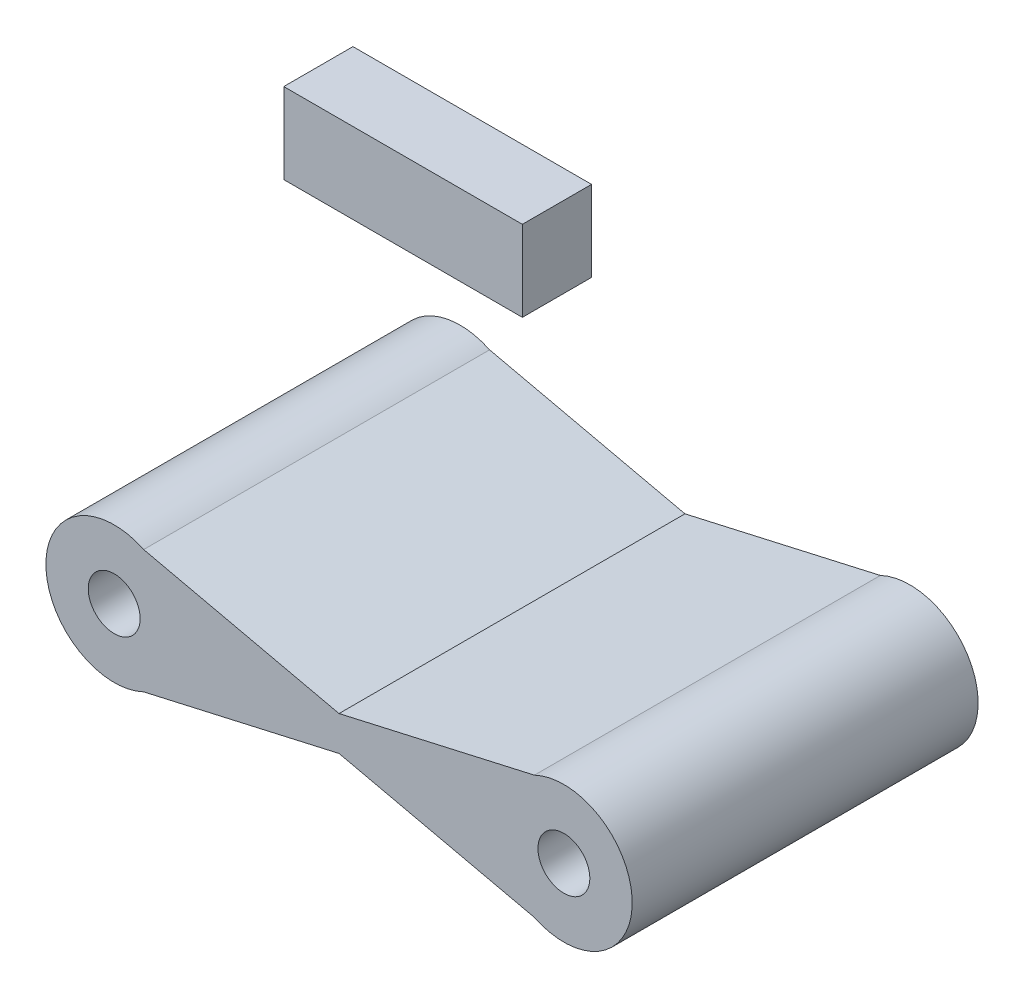
ISO-10303-21;
HEADER;
FILE_DESCRIPTION(('STEP AP214'),'2;1');
FILE_NAME('part.step','',(''),(''),'','','');
FILE_SCHEMA(('AUTOMOTIVE_DESIGN { 1 0 10303 214 1 1 1 1 }'));
ENDSEC;
DATA;
#1=APPLICATION_CONTEXT('core data for automotive mechanical design processes');
#2=APPLICATION_PROTOCOL_DEFINITION('international standard','automotive_design',2000,#1);
#3=PRODUCT_CONTEXT('',#1,'mechanical');
#4=PRODUCT('Part','Part','',(#3));
#5=PRODUCT_RELATED_PRODUCT_CATEGORY('part','',(#4));
#6=PRODUCT_DEFINITION_FORMATION('','',#4);
#7=PRODUCT_DEFINITION_CONTEXT('part definition',#1,'design');
#8=PRODUCT_DEFINITION('design','',#6,#7);
#9=PRODUCT_DEFINITION_SHAPE('','',#8);
#10=(LENGTH_UNIT() NAMED_UNIT(*) SI_UNIT(.MILLI.,.METRE.));
#11=(NAMED_UNIT(*) PLANE_ANGLE_UNIT() SI_UNIT($,.RADIAN.));
#12=(NAMED_UNIT(*) SI_UNIT($,.STERADIAN.) SOLID_ANGLE_UNIT());
#13=UNCERTAINTY_MEASURE_WITH_UNIT(LENGTH_MEASURE(1.E-05),#10,'distance_accuracy_value','');
#14=(GEOMETRIC_REPRESENTATION_CONTEXT(3) GLOBAL_UNCERTAINTY_ASSIGNED_CONTEXT((#13)) GLOBAL_UNIT_ASSIGNED_CONTEXT((#10,
#11,#12)) REPRESENTATION_CONTEXT('',''));
#15=CARTESIAN_POINT('',(0.,0.,0.));
#16=DIRECTION('',(0.,0.,1.));
#17=DIRECTION('',(1.,0.,0.));
#18=AXIS2_PLACEMENT_3D('',#15,#16,#17);
#19=CARTESIAN_POINT('',(3.79954310221819,7.89798638635375,2.));
#20=DIRECTION('',(1.,0.,0.));
#21=DIRECTION('',(0.,0.,-1.));
#22=AXIS2_PLACEMENT_3D('',#19,#20,#21);
#23=PLANE('',#22);
#24=DIRECTION('',(0.,-1.,0.));
#25=VECTOR('',#24,1.);
#26=CARTESIAN_POINT('',(3.79954310221819,7.89798638635375,0.));
#27=LINE('',#26,#25);
#28=CARTESIAN_POINT('',(3.79954310221819,7.89798638635375,0.));
#29=VERTEX_POINT('',#28);
#30=CARTESIAN_POINT('',(3.79954310221819,5.56807422900363,0.));
#31=VERTEX_POINT('',#30);
#32=EDGE_CURVE('E109',#29,#31,#27,.T.);
#33=ORIENTED_EDGE('',*,*,#32,.F.);
#34=DIRECTION('',(0.,0.,-1.));
#35=VECTOR('',#34,1.);
#36=CARTESIAN_POINT('',(3.79954310221819,7.89798638635375,2.));
#37=LINE('',#36,#35);
#38=CARTESIAN_POINT('',(3.79954310221819,7.89798638635375,2.));
#39=VERTEX_POINT('',#38);
#40=EDGE_CURVE('E12',#39,#29,#37,.T.);
#41=ORIENTED_EDGE('',*,*,#40,.F.);
#42=DIRECTION('',(0.,-1.,0.));
#43=VECTOR('',#42,1.);
#44=CARTESIAN_POINT('',(3.79954310221819,7.89798638635375,2.));
#45=LINE('',#44,#43);
#46=CARTESIAN_POINT('',(3.79954310221819,5.56807422900363,2.));
#47=VERTEX_POINT('',#46);
#48=EDGE_CURVE('E103',#39,#47,#45,.T.);
#49=ORIENTED_EDGE('',*,*,#48,.T.);
#50=DIRECTION('',(0.,0.,-1.));
#51=VECTOR('',#50,1.);
#52=CARTESIAN_POINT('',(3.79954310221819,5.56807422900363,2.));
#53=LINE('',#52,#51);
#54=EDGE_CURVE('E48',#47,#31,#53,.T.);
#55=ORIENTED_EDGE('',*,*,#54,.T.);
#56=EDGE_LOOP('',(#33,#41,#49,#55));
#57=FACE_BOUND('',#56,.T.);
#58=ADVANCED_FACE('F45',(#57),#23,.T.);
#59=CARTESIAN_POINT('',(3.79954310221819,7.89798638635375,2.));
#60=DIRECTION('',(0.,1.,0.));
#61=DIRECTION('',(0.,0.,1.));
#62=AXIS2_PLACEMENT_3D('',#59,#60,#61);
#63=PLANE('',#62);
#64=DIRECTION('',(1.,0.,0.));
#65=VECTOR('',#64,1.);
#66=CARTESIAN_POINT('',(3.79954310221819,7.89798638635375,0.));
#67=LINE('',#66,#65);
#68=CARTESIAN_POINT('',(-3.09786046466343,7.89798638635375,0.));
#69=VERTEX_POINT('',#68);
#70=EDGE_CURVE('E105',#69,#29,#67,.T.);
#71=ORIENTED_EDGE('',*,*,#70,.F.);
#72=DIRECTION('',(0.,0.,-1.));
#73=VECTOR('',#72,1.);
#74=CARTESIAN_POINT('',(-3.09786046466343,7.89798638635375,2.));
#75=LINE('',#74,#73);
#76=CARTESIAN_POINT('',(-3.09786046466343,7.89798638635375,2.));
#77=VERTEX_POINT('',#76);
#78=EDGE_CURVE('E54',#77,#69,#75,.T.);
#79=ORIENTED_EDGE('',*,*,#78,.F.);
#80=DIRECTION('',(1.,0.,0.));
#81=VECTOR('',#80,1.);
#82=CARTESIAN_POINT('',(3.79954310221819,7.89798638635375,2.));
#83=LINE('',#82,#81);
#84=EDGE_CURVE('E100',#77,#39,#83,.T.);
#85=ORIENTED_EDGE('',*,*,#84,.T.);
#86=ORIENTED_EDGE('',*,*,#40,.T.);
#87=EDGE_LOOP('',(#71,#79,#85,#86));
#88=FACE_BOUND('',#87,.T.);
#89=ADVANCED_FACE('F119',(#88),#63,.T.);
#90=CARTESIAN_POINT('',(-3.09786046466343,7.89798638635375,2.));
#91=DIRECTION('',(-1.,0.,0.));
#92=DIRECTION('',(0.,0.,1.));
#93=AXIS2_PLACEMENT_3D('',#90,#91,#92);
#94=PLANE('',#93);
#95=DIRECTION('',(0.,1.,0.));
#96=VECTOR('',#95,1.);
#97=CARTESIAN_POINT('',(-3.09786046466343,7.89798638635375,0.));
#98=LINE('',#97,#96);
#99=CARTESIAN_POINT('',(-3.09786046466343,5.56807422900363,0.));
#100=VERTEX_POINT('',#99);
#101=EDGE_CURVE('E95',#100,#69,#98,.T.);
#102=ORIENTED_EDGE('',*,*,#101,.F.);
#103=DIRECTION('',(0.,0.,-1.));
#104=VECTOR('',#103,1.);
#105=CARTESIAN_POINT('',(-3.09786046466343,5.56807422900363,2.));
#106=LINE('',#105,#104);
#107=CARTESIAN_POINT('',(-3.09786046466343,5.56807422900363,2.));
#108=VERTEX_POINT('',#107);
#109=EDGE_CURVE('E90',#108,#100,#106,.T.);
#110=ORIENTED_EDGE('',*,*,#109,.F.);
#111=DIRECTION('',(0.,1.,0.));
#112=VECTOR('',#111,1.);
#113=CARTESIAN_POINT('',(-3.09786046466343,7.89798638635375,2.));
#114=LINE('',#113,#112);
#115=EDGE_CURVE('E93',#108,#77,#114,.T.);
#116=ORIENTED_EDGE('',*,*,#115,.T.);
#117=ORIENTED_EDGE('',*,*,#78,.T.);
#118=EDGE_LOOP('',(#102,#110,#116,#117));
#119=FACE_BOUND('',#118,.T.);
#120=ADVANCED_FACE('F92',(#119),#94,.T.);
#121=CARTESIAN_POINT('',(3.79954310221819,5.56807422900363,2.));
#122=DIRECTION('',(0.,-1.,0.));
#123=DIRECTION('',(0.,0.,-1.));
#124=AXIS2_PLACEMENT_3D('',#121,#122,#123);
#125=PLANE('',#124);
#126=DIRECTION('',(-1.,0.,0.));
#127=VECTOR('',#126,1.);
#128=CARTESIAN_POINT('',(3.79954310221819,5.56807422900363,0.));
#129=LINE('',#128,#127);
#130=EDGE_CURVE('E112',#31,#100,#129,.T.);
#131=ORIENTED_EDGE('',*,*,#130,.F.);
#132=ORIENTED_EDGE('',*,*,#54,.F.);
#133=DIRECTION('',(-1.,0.,0.));
#134=VECTOR('',#133,1.);
#135=CARTESIAN_POINT('',(3.79954310221819,5.56807422900363,2.));
#136=LINE('',#135,#134);
#137=EDGE_CURVE('E99',#47,#108,#136,.T.);
#138=ORIENTED_EDGE('',*,*,#137,.T.);
#139=ORIENTED_EDGE('',*,*,#109,.T.);
#140=EDGE_LOOP('',(#131,#132,#138,#139));
#141=FACE_BOUND('',#140,.T.);
#142=ADVANCED_FACE('F102',(#141),#125,.T.);
#143=CARTESIAN_POINT('',(0.,0.,2.));
#144=DIRECTION('',(0.,0.,-1.));
#145=DIRECTION('',(-1.,0.,0.));
#146=AXIS2_PLACEMENT_3D('',#143,#144,#145);
#147=PLANE('',#146);
#148=ORIENTED_EDGE('',*,*,#48,.F.);
#149=ORIENTED_EDGE('',*,*,#84,.F.);
#150=ORIENTED_EDGE('',*,*,#115,.F.);
#151=ORIENTED_EDGE('',*,*,#137,.F.);
#152=EDGE_LOOP('',(#148,#149,#150,#151));
#153=FACE_BOUND('',#152,.T.);
#154=ADVANCED_FACE('F98',(#153),#147,.F.);
#155=CARTESIAN_POINT('',(0.,0.,0.));
#156=DIRECTION('',(0.,0.,-1.));
#157=DIRECTION('',(-1.,0.,0.));
#158=AXIS2_PLACEMENT_3D('',#155,#156,#157);
#159=PLANE('',#158);
#160=ORIENTED_EDGE('',*,*,#32,.T.);
#161=ORIENTED_EDGE('',*,*,#130,.T.);
#162=ORIENTED_EDGE('',*,*,#101,.T.);
#163=ORIENTED_EDGE('',*,*,#70,.T.);
#164=EDGE_LOOP('',(#160,#161,#162,#163));
#165=FACE_BOUND('',#164,.T.);
#166=ADVANCED_FACE('F118',(#165),#159,.T.);
#167=CLOSED_SHELL('',(#58,#89,#120,#142,#154,#166));
#168=MANIFOLD_SOLID_BREP('B2',#167);
#169=CARTESIAN_POINT('',(0.318319944851648,1.40276585866828,10.));
#170=DIRECTION('',(-0.221296857654929,-0.975206491360704,0.));
#171=DIRECTION('',(0.975206491360704,-0.221296857654929,0.));
#172=AXIS2_PLACEMENT_3D('',#169,#170,#171);
#173=PLANE('',#172);
#174=DIRECTION('',(-0.975206491360704,0.221296857654929,0.));
#175=VECTOR('',#174,1.);
#176=CARTESIAN_POINT('',(0.318319944851648,1.40276585866828,0.));
#177=LINE('',#176,#175);
#178=CARTESIAN_POINT('',(12.1475499781939,-1.28155941812862,0.));
#179=VERTEX_POINT('',#178);
#180=CARTESIAN_POINT('',(6.5,0.,0.));
#181=VERTEX_POINT('',#180);
#182=EDGE_CURVE('E262',#179,#181,#177,.T.);
#183=ORIENTED_EDGE('',*,*,#182,.F.);
#184=DIRECTION('',(0.,0.,-1.));
#185=VECTOR('',#184,1.);
#186=CARTESIAN_POINT('',(12.1475499781939,-1.28155941812862,10.));
#187=LINE('',#186,#185);
#188=CARTESIAN_POINT('',(12.1475499781939,-1.28155941812862,10.));
#189=VERTEX_POINT('',#188);
#190=EDGE_CURVE('E43',#189,#179,#187,.T.);
#191=ORIENTED_EDGE('',*,*,#190,.F.);
#192=DIRECTION('',(-0.975206491360704,0.221296857654929,0.));
#193=VECTOR('',#192,1.);
#194=CARTESIAN_POINT('',(0.318319944851648,1.40276585866828,10.));
#195=LINE('',#194,#193);
#196=CARTESIAN_POINT('',(6.5,0.,10.));
#197=VERTEX_POINT('',#196);
#198=EDGE_CURVE('E322',#189,#197,#195,.T.);
#199=ORIENTED_EDGE('',*,*,#198,.T.);
#200=DIRECTION('',(0.,0.,-1.));
#201=VECTOR('',#200,1.);
#202=CARTESIAN_POINT('',(6.5,0.,10.));
#203=LINE('',#202,#201);
#204=EDGE_CURVE('E215',#197,#181,#203,.T.);
#205=ORIENTED_EDGE('',*,*,#204,.T.);
#206=EDGE_LOOP('',(#183,#191,#199,#205));
#207=FACE_BOUND('',#206,.T.);
#208=ADVANCED_FACE('F169',(#207),#173,.T.);
#209=CARTESIAN_POINT('',(13.,0.5,10.));
#210=DIRECTION('',(0.,0.,-1.));
#211=DIRECTION('',(-1.,0.,0.));
#212=AXIS2_PLACEMENT_3D('',#209,#210,#211);
#213=CYLINDRICAL_SURFACE('',#212,1.97499999999999);
#214=CARTESIAN_POINT('',(13.,0.5,0.));
#215=DIRECTION('',(0.,0.,1.));
#216=DIRECTION('',(1.,0.,0.));
#217=AXIS2_PLACEMENT_3D('',#214,#215,#216);
#218=CIRCLE('',#217,1.97499999999999);
#219=CARTESIAN_POINT('',(12.1475499781939,2.28155941812862,0.));
#220=VERTEX_POINT('',#219);
#221=EDGE_CURVE('E264',#179,#220,#218,.T.);
#222=ORIENTED_EDGE('',*,*,#221,.T.);
#223=DIRECTION('',(0.,0.,-1.));
#224=VECTOR('',#223,1.);
#225=CARTESIAN_POINT('',(12.1475499781939,2.28155941812862,10.));
#226=LINE('',#225,#224);
#227=CARTESIAN_POINT('',(12.1475499781939,2.28155941812862,10.));
#228=VERTEX_POINT('',#227);
#229=EDGE_CURVE('E178',#228,#220,#226,.T.);
#230=ORIENTED_EDGE('',*,*,#229,.F.);
#231=CARTESIAN_POINT('',(13.,0.5,10.));
#232=DIRECTION('',(0.,0.,1.));
#233=DIRECTION('',(1.,0.,0.));
#234=AXIS2_PLACEMENT_3D('',#231,#232,#233);
#235=CIRCLE('',#234,1.97499999999999);
#236=EDGE_CURVE('E251',#189,#228,#235,.T.);
#237=ORIENTED_EDGE('',*,*,#236,.F.);
#238=ORIENTED_EDGE('',*,*,#190,.T.);
#239=EDGE_LOOP('',(#222,#230,#237,#238));
#240=FACE_BOUND('',#239,.T.);
#241=ADVANCED_FACE('F286',(#240),#213,.T.);
#242=CARTESIAN_POINT('',(0.102509812748837,-0.45173815787623,10.));
#243=DIRECTION('',(-0.221296857654929,0.975206491360704,0.));
#244=DIRECTION('',(-0.975206491360704,-0.221296857654929,0.));
#245=AXIS2_PLACEMENT_3D('',#242,#243,#244);
#246=PLANE('',#245);
#247=DIRECTION('',(0.975206491360704,0.221296857654929,0.));
#248=VECTOR('',#247,1.);
#249=CARTESIAN_POINT('',(0.102509812748837,-0.45173815787623,0.));
#250=LINE('',#249,#248);
#251=CARTESIAN_POINT('',(6.5,0.999999999999999,0.));
#252=VERTEX_POINT('',#251);
#253=EDGE_CURVE('E267',#252,#220,#250,.T.);
#254=ORIENTED_EDGE('',*,*,#253,.F.);
#255=DIRECTION('',(0.,0.,-1.));
#256=VECTOR('',#255,1.);
#257=CARTESIAN_POINT('',(6.5,0.999999999999999,10.));
#258=LINE('',#257,#256);
#259=CARTESIAN_POINT('',(6.5,0.999999999999999,10.));
#260=VERTEX_POINT('',#259);
#261=EDGE_CURVE('E238',#260,#252,#258,.T.);
#262=ORIENTED_EDGE('',*,*,#261,.F.);
#263=DIRECTION('',(0.975206491360704,0.221296857654929,0.));
#264=VECTOR('',#263,1.);
#265=CARTESIAN_POINT('',(0.102509812748837,-0.45173815787623,10.));
#266=LINE('',#265,#264);
#267=EDGE_CURVE('E249',#260,#228,#266,.T.);
#268=ORIENTED_EDGE('',*,*,#267,.T.);
#269=ORIENTED_EDGE('',*,*,#229,.T.);
#270=EDGE_LOOP('',(#254,#262,#268,#269));
#271=FACE_BOUND('',#270,.T.);
#272=ADVANCED_FACE('F283',(#271),#246,.T.);
#273=CARTESIAN_POINT('',(0.534130076954461,2.35379355946033,10.));
#274=DIRECTION('',(0.221296857654929,0.975206491360704,0.));
#275=DIRECTION('',(-0.975206491360704,0.221296857654929,0.));
#276=AXIS2_PLACEMENT_3D('',#273,#274,#275);
#277=PLANE('',#276);
#278=DIRECTION('',(0.975206491360704,-0.221296857654929,0.));
#279=VECTOR('',#278,1.);
#280=CARTESIAN_POINT('',(0.534130076954461,2.35379355946033,0.));
#281=LINE('',#280,#279);
#282=CARTESIAN_POINT('',(0.852450021806109,2.28155941812861,0.));
#283=VERTEX_POINT('',#282);
#284=EDGE_CURVE('E235',#283,#252,#281,.T.);
#285=ORIENTED_EDGE('',*,*,#284,.F.);
#286=DIRECTION('',(0.,0.,-1.));
#287=VECTOR('',#286,1.);
#288=CARTESIAN_POINT('',(0.852450021806109,2.28155941812861,10.));
#289=LINE('',#288,#287);
#290=CARTESIAN_POINT('',(0.852450021806109,2.28155941812861,10.));
#291=VERTEX_POINT('',#290);
#292=EDGE_CURVE('E229',#291,#283,#289,.T.);
#293=ORIENTED_EDGE('',*,*,#292,.F.);
#294=DIRECTION('',(0.975206491360704,-0.221296857654929,0.));
#295=VECTOR('',#294,1.);
#296=CARTESIAN_POINT('',(0.534130076954461,2.35379355946033,10.));
#297=LINE('',#296,#295);
#298=EDGE_CURVE('E233',#291,#260,#297,.T.);
#299=ORIENTED_EDGE('',*,*,#298,.T.);
#300=ORIENTED_EDGE('',*,*,#261,.T.);
#301=EDGE_LOOP('',(#285,#293,#299,#300));
#302=FACE_BOUND('',#301,.T.);
#303=ADVANCED_FACE('F231',(#302),#277,.T.);
#304=CARTESIAN_POINT('',(0.,0.5,10.));
#305=DIRECTION('',(0.,0.,-1.));
#306=DIRECTION('',(-1.,0.,0.));
#307=AXIS2_PLACEMENT_3D('',#304,#305,#306);
#308=CYLINDRICAL_SURFACE('',#307,1.975);
#309=CARTESIAN_POINT('',(0.,0.5,0.));
#310=DIRECTION('',(0.,0.,1.));
#311=DIRECTION('',(1.,0.,0.));
#312=AXIS2_PLACEMENT_3D('',#309,#310,#311);
#313=CIRCLE('',#312,1.975);
#314=CARTESIAN_POINT('',(0.852450021806107,-1.28155941812861,0.));
#315=VERTEX_POINT('',#314);
#316=EDGE_CURVE('E271',#283,#315,#313,.T.);
#317=ORIENTED_EDGE('',*,*,#316,.T.);
#318=DIRECTION('',(0.,0.,-1.));
#319=VECTOR('',#318,1.);
#320=CARTESIAN_POINT('',(0.852450021806107,-1.28155941812861,10.));
#321=LINE('',#320,#319);
#322=CARTESIAN_POINT('',(0.852450021806107,-1.28155941812861,10.));
#323=VERTEX_POINT('',#322);
#324=EDGE_CURVE('E239',#323,#315,#321,.T.);
#325=ORIENTED_EDGE('',*,*,#324,.F.);
#326=CARTESIAN_POINT('',(0.,0.5,10.));
#327=DIRECTION('',(0.,0.,1.));
#328=DIRECTION('',(1.,0.,0.));
#329=AXIS2_PLACEMENT_3D('',#326,#327,#328);
#330=CIRCLE('',#329,1.975);
#331=EDGE_CURVE('E242',#291,#323,#330,.T.);
#332=ORIENTED_EDGE('',*,*,#331,.F.);
#333=ORIENTED_EDGE('',*,*,#292,.T.);
#334=EDGE_LOOP('',(#317,#325,#332,#333));
#335=FACE_BOUND('',#334,.T.);
#336=ADVANCED_FACE('F243',(#335),#308,.T.);
#337=CARTESIAN_POINT('',(0.318319944851648,-1.40276585866828,10.));
#338=DIRECTION('',(-0.221296857654929,0.975206491360704,0.));
#339=DIRECTION('',(-0.975206491360704,-0.221296857654929,0.));
#340=AXIS2_PLACEMENT_3D('',#337,#338,#339);
#341=PLANE('',#340);
#342=DIRECTION('',(0.975206491360704,0.221296857654929,0.));
#343=VECTOR('',#342,1.);
#344=CARTESIAN_POINT('',(0.318319944851648,-1.40276585866828,0.));
#345=LINE('',#344,#343);
#346=EDGE_CURVE('E208',#315,#181,#345,.T.);
#347=ORIENTED_EDGE('',*,*,#346,.T.);
#348=ORIENTED_EDGE('',*,*,#204,.F.);
#349=DIRECTION('',(0.975206491360704,0.221296857654929,0.));
#350=VECTOR('',#349,1.);
#351=CARTESIAN_POINT('',(0.318319944851648,-1.40276585866828,10.));
#352=LINE('',#351,#350);
#353=EDGE_CURVE('E186',#323,#197,#352,.T.);
#354=ORIENTED_EDGE('',*,*,#353,.F.);
#355=ORIENTED_EDGE('',*,*,#324,.T.);
#356=EDGE_LOOP('',(#347,#348,#354,#355));
#357=FACE_BOUND('',#356,.T.);
#358=ADVANCED_FACE('F304',(#357),#341,.F.);
#359=CARTESIAN_POINT('',(13.,0.5,10.));
#360=DIRECTION('',(0.,0.,-1.));
#361=DIRECTION('',(-1.,0.,0.));
#362=AXIS2_PLACEMENT_3D('',#359,#360,#361);
#363=CYLINDRICAL_SURFACE('',#362,0.750000000000002);
#364=CARTESIAN_POINT('',(13.,0.5,10.));
#365=DIRECTION('',(0.,0.,1.));
#366=DIRECTION('',(1.,0.,0.));
#367=AXIS2_PLACEMENT_3D('',#364,#365,#366);
#368=CIRCLE('',#367,0.750000000000002);
#369=CARTESIAN_POINT('',(13.75,0.5,10.));
#370=VERTEX_POINT('',#369);
#371=EDGE_CURVE('E277',#370,#370,#368,.T.);
#372=ORIENTED_EDGE('',*,*,#371,.T.);
#373=EDGE_LOOP('',(#372));
#374=FACE_BOUND('',#373,.T.);
#375=CARTESIAN_POINT('',(13.,0.5,0.));
#376=DIRECTION('',(0.,0.,1.));
#377=DIRECTION('',(1.,0.,0.));
#378=AXIS2_PLACEMENT_3D('',#375,#376,#377);
#379=CIRCLE('',#378,0.750000000000002);
#380=CARTESIAN_POINT('',(13.75,0.5,0.));
#381=VERTEX_POINT('',#380);
#382=EDGE_CURVE('E259',#381,#381,#379,.T.);
#383=ORIENTED_EDGE('',*,*,#382,.F.);
#384=EDGE_LOOP('',(#383));
#385=FACE_BOUND('',#384,.T.);
#386=ADVANCED_FACE('F171',(#374,#385),#363,.F.);
#387=CARTESIAN_POINT('',(0.,0.5,10.));
#388=DIRECTION('',(0.,0.,-1.));
#389=DIRECTION('',(-1.,0.,0.));
#390=AXIS2_PLACEMENT_3D('',#387,#388,#389);
#391=CYLINDRICAL_SURFACE('',#390,0.75);
#392=CARTESIAN_POINT('',(0.,0.5,10.));
#393=DIRECTION('',(0.,0.,1.));
#394=DIRECTION('',(1.,0.,0.));
#395=AXIS2_PLACEMENT_3D('',#392,#393,#394);
#396=CIRCLE('',#395,0.75);
#397=CARTESIAN_POINT('',(0.75,0.5,10.));
#398=VERTEX_POINT('',#397);
#399=EDGE_CURVE('E256',#398,#398,#396,.T.);
#400=ORIENTED_EDGE('',*,*,#399,.T.);
#401=EDGE_LOOP('',(#400));
#402=FACE_BOUND('',#401,.T.);
#403=CARTESIAN_POINT('',(0.,0.5,0.));
#404=DIRECTION('',(0.,0.,1.));
#405=DIRECTION('',(1.,0.,0.));
#406=AXIS2_PLACEMENT_3D('',#403,#404,#405);
#407=CIRCLE('',#406,0.75);
#408=CARTESIAN_POINT('',(0.75,0.5,0.));
#409=VERTEX_POINT('',#408);
#410=EDGE_CURVE('E274',#409,#409,#407,.T.);
#411=ORIENTED_EDGE('',*,*,#410,.F.);
#412=EDGE_LOOP('',(#411));
#413=FACE_BOUND('',#412,.T.);
#414=ADVANCED_FACE('F294',(#402,#413),#391,.F.);
#415=CARTESIAN_POINT('',(0.,0.,10.));
#416=DIRECTION('',(0.,0.,1.));
#417=DIRECTION('',(1.,0.,0.));
#418=AXIS2_PLACEMENT_3D('',#415,#416,#417);
#419=PLANE('',#418);
#420=ORIENTED_EDGE('',*,*,#371,.F.);
#421=EDGE_LOOP('',(#420));
#422=FACE_BOUND('',#421,.T.);
#423=ORIENTED_EDGE('',*,*,#198,.F.);
#424=ORIENTED_EDGE('',*,*,#236,.T.);
#425=ORIENTED_EDGE('',*,*,#267,.F.);
#426=ORIENTED_EDGE('',*,*,#298,.F.);
#427=ORIENTED_EDGE('',*,*,#331,.T.);
#428=ORIENTED_EDGE('',*,*,#353,.T.);
#429=EDGE_LOOP('',(#423,#424,#425,#426,#427,#428));
#430=FACE_BOUND('',#429,.T.);
#431=ORIENTED_EDGE('',*,*,#399,.F.);
#432=EDGE_LOOP('',(#431));
#433=FACE_BOUND('',#432,.T.);
#434=ADVANCED_FACE('F246',(#422,#430,#433),#419,.T.);
#435=CARTESIAN_POINT('',(0.,0.,0.));
#436=DIRECTION('',(0.,0.,1.));
#437=DIRECTION('',(1.,0.,0.));
#438=AXIS2_PLACEMENT_3D('',#435,#436,#437);
#439=PLANE('',#438);
#440=ORIENTED_EDGE('',*,*,#382,.T.);
#441=EDGE_LOOP('',(#440));
#442=FACE_BOUND('',#441,.T.);
#443=ORIENTED_EDGE('',*,*,#182,.T.);
#444=ORIENTED_EDGE('',*,*,#346,.F.);
#445=ORIENTED_EDGE('',*,*,#316,.F.);
#446=ORIENTED_EDGE('',*,*,#284,.T.);
#447=ORIENTED_EDGE('',*,*,#253,.T.);
#448=ORIENTED_EDGE('',*,*,#221,.F.);
#449=EDGE_LOOP('',(#443,#444,#445,#446,#447,#448));
#450=FACE_BOUND('',#449,.T.);
#451=ORIENTED_EDGE('',*,*,#410,.T.);
#452=EDGE_LOOP('',(#451));
#453=FACE_BOUND('',#452,.T.);
#454=ADVANCED_FACE('F287',(#442,#450,#453),#439,.F.);
#455=CLOSED_SHELL('',(#208,#241,#272,#303,#336,#358,#386,#414,#434,#454));
#456=MANIFOLD_SOLID_BREP('B6',#455);
#457=ADVANCED_BREP_SHAPE_REPRESENTATION('',(#18,#168,#456),#14);
#458=SHAPE_DEFINITION_REPRESENTATION(#9,#457);
ENDSEC;
END-ISO-10303-21;
